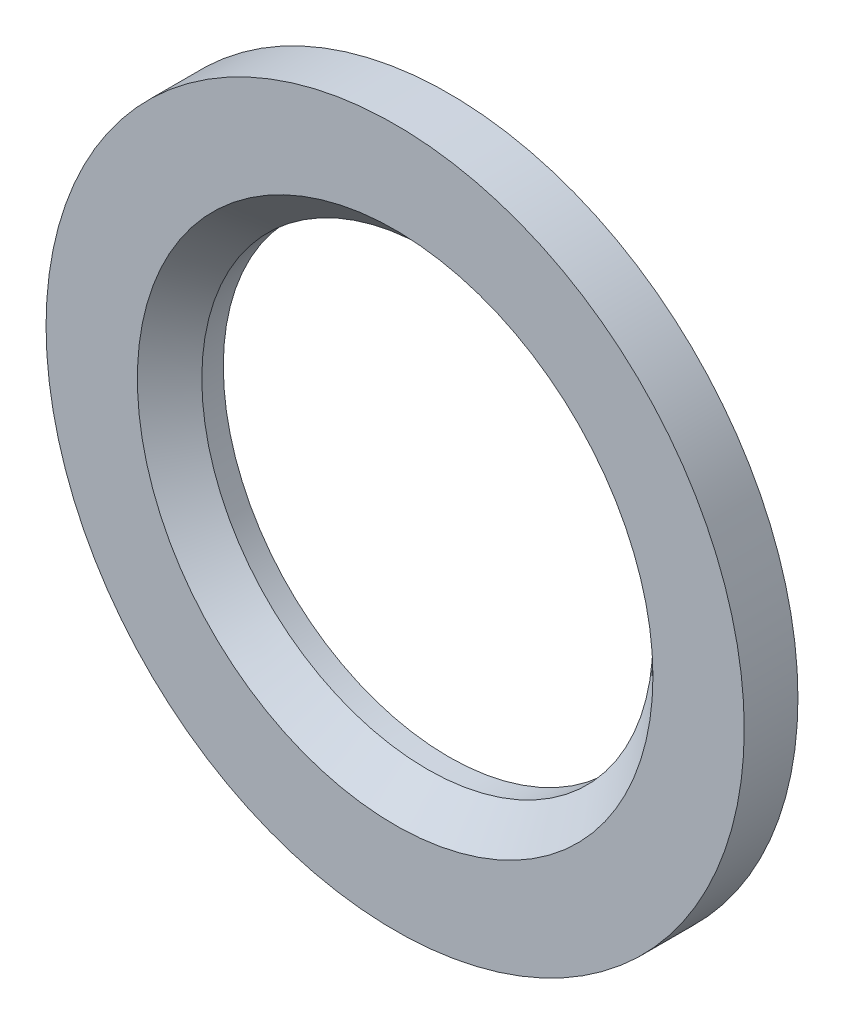
ISO-10303-21;
HEADER;
FILE_DESCRIPTION(('STEP AP214'),'2;1');
FILE_NAME('part.step','',(''),(''),'','','');
FILE_SCHEMA(('AUTOMOTIVE_DESIGN { 1 0 10303 214 1 1 1 1 }'));
ENDSEC;
DATA;
#1=APPLICATION_CONTEXT('core data for automotive mechanical design processes');
#2=APPLICATION_PROTOCOL_DEFINITION('international standard','automotive_design',2000,#1);
#3=PRODUCT_CONTEXT('',#1,'mechanical');
#4=PRODUCT('Part','Part','',(#3));
#5=PRODUCT_RELATED_PRODUCT_CATEGORY('part','',(#4));
#6=PRODUCT_DEFINITION_FORMATION('','',#4);
#7=PRODUCT_DEFINITION_CONTEXT('part definition',#1,'design');
#8=PRODUCT_DEFINITION('design','',#6,#7);
#9=PRODUCT_DEFINITION_SHAPE('','',#8);
#10=(LENGTH_UNIT() NAMED_UNIT(*) SI_UNIT(.MILLI.,.METRE.));
#11=(NAMED_UNIT(*) PLANE_ANGLE_UNIT() SI_UNIT($,.RADIAN.));
#12=(NAMED_UNIT(*) SI_UNIT($,.STERADIAN.) SOLID_ANGLE_UNIT());
#13=UNCERTAINTY_MEASURE_WITH_UNIT(LENGTH_MEASURE(1.E-05),#10,'distance_accuracy_value','');
#14=(GEOMETRIC_REPRESENTATION_CONTEXT(3) GLOBAL_UNCERTAINTY_ASSIGNED_CONTEXT((#13)) GLOBAL_UNIT_ASSIGNED_CONTEXT((#10,
#11,#12)) REPRESENTATION_CONTEXT('',''));
#15=CARTESIAN_POINT('',(0.,0.,0.));
#16=DIRECTION('',(0.,0.,1.));
#17=DIRECTION('',(1.,0.,0.));
#18=AXIS2_PLACEMENT_3D('',#15,#16,#17);
#19=CARTESIAN_POINT('',(0.,0.,1.));
#20=DIRECTION('',(0.,0.,1.));
#21=DIRECTION('',(1.,0.,0.));
#22=AXIS2_PLACEMENT_3D('',#19,#20,#21);
#23=PLANE('',#22);
#24=CARTESIAN_POINT('',(0.,0.,1.));
#25=DIRECTION('',(0.,0.,1.));
#26=DIRECTION('',(1.,0.,0.));
#27=AXIS2_PLACEMENT_3D('',#24,#25,#26);
#28=CIRCLE('',#27,4.8);
#29=CARTESIAN_POINT('',(4.8,0.,1.));
#30=VERTEX_POINT('',#29);
#31=EDGE_CURVE('E10',#30,#30,#28,.F.);
#32=ORIENTED_EDGE('',*,*,#31,.T.);
#33=EDGE_LOOP('',(#32));
#34=FACE_BOUND('',#33,.T.);
#35=CARTESIAN_POINT('',(0.,0.,1.));
#36=DIRECTION('',(0.,0.,1.));
#37=DIRECTION('',(1.,0.,0.));
#38=AXIS2_PLACEMENT_3D('',#35,#36,#37);
#39=CIRCLE('',#38,6.5);
#40=CARTESIAN_POINT('',(6.5,0.,1.));
#41=VERTEX_POINT('',#40);
#42=EDGE_CURVE('E42',#41,#41,#39,.T.);
#43=ORIENTED_EDGE('',*,*,#42,.T.);
#44=EDGE_LOOP('',(#43));
#45=FACE_BOUND('',#44,.T.);
#46=ADVANCED_FACE('F31',(#34,#45),#23,.T.);
#47=CARTESIAN_POINT('',(0.,0.,0.));
#48=DIRECTION('',(0.,0.,1.));
#49=DIRECTION('',(1.,0.,0.));
#50=AXIS2_PLACEMENT_3D('',#47,#48,#49);
#51=PLANE('',#50);
#52=CARTESIAN_POINT('',(0.,0.,0.));
#53=DIRECTION('',(0.,0.,1.));
#54=DIRECTION('',(1.,0.,0.));
#55=AXIS2_PLACEMENT_3D('',#52,#53,#54);
#56=CIRCLE('',#55,6.5);
#57=CARTESIAN_POINT('',(6.5,0.,0.));
#58=VERTEX_POINT('',#57);
#59=EDGE_CURVE('E46',#58,#58,#56,.T.);
#60=ORIENTED_EDGE('',*,*,#59,.F.);
#61=EDGE_LOOP('',(#60));
#62=FACE_BOUND('',#61,.T.);
#63=CARTESIAN_POINT('',(0.,0.,0.));
#64=DIRECTION('',(0.,0.,1.));
#65=DIRECTION('',(1.,0.,0.));
#66=AXIS2_PLACEMENT_3D('',#63,#64,#65);
#67=CIRCLE('',#66,4.2);
#68=CARTESIAN_POINT('',(4.2,0.,0.));
#69=VERTEX_POINT('',#68);
#70=EDGE_CURVE('E50',#69,#69,#67,.T.);
#71=ORIENTED_EDGE('',*,*,#70,.T.);
#72=EDGE_LOOP('',(#71));
#73=FACE_BOUND('',#72,.T.);
#74=ADVANCED_FACE('F55',(#62,#73),#51,.F.);
#75=CARTESIAN_POINT('',(0.,0.,1.));
#76=DIRECTION('',(0.,0.,-1.));
#77=DIRECTION('',(-1.,0.,0.));
#78=AXIS2_PLACEMENT_3D('',#75,#76,#77);
#79=CYLINDRICAL_SURFACE('',#78,6.5);
#80=ORIENTED_EDGE('',*,*,#42,.F.);
#81=EDGE_LOOP('',(#80));
#82=FACE_BOUND('',#81,.T.);
#83=ORIENTED_EDGE('',*,*,#59,.T.);
#84=EDGE_LOOP('',(#83));
#85=FACE_BOUND('',#84,.T.);
#86=ADVANCED_FACE('F59',(#82,#85),#79,.T.);
#87=CARTESIAN_POINT('',(0.,0.,1.));
#88=DIRECTION('',(0.,0.,-1.));
#89=DIRECTION('',(-1.,0.,0.));
#90=AXIS2_PLACEMENT_3D('',#87,#88,#89);
#91=CYLINDRICAL_SURFACE('',#90,4.2);
#92=CARTESIAN_POINT('',(0.,0.,0.400000000000004));
#93=DIRECTION('',(0.,0.,1.));
#94=DIRECTION('',(1.,0.,0.));
#95=AXIS2_PLACEMENT_3D('',#92,#93,#94);
#96=CIRCLE('',#95,4.2);
#97=CARTESIAN_POINT('',(4.2,0.,0.400000000000004));
#98=VERTEX_POINT('',#97);
#99=EDGE_CURVE('E38',#98,#98,#96,.T.);
#100=ORIENTED_EDGE('',*,*,#99,.T.);
#101=EDGE_LOOP('',(#100));
#102=FACE_BOUND('',#101,.T.);
#103=ORIENTED_EDGE('',*,*,#70,.F.);
#104=EDGE_LOOP('',(#103));
#105=FACE_BOUND('',#104,.T.);
#106=ADVANCED_FACE('F57',(#102,#105),#91,.F.);
#107=CARTESIAN_POINT('',(0.,0.,0.400000000000004));
#108=DIRECTION('',(0.,0.,1.));
#109=DIRECTION('',(1.,0.,0.));
#110=AXIS2_PLACEMENT_3D('',#107,#108,#109);
#111=CONICAL_SURFACE('',#110,4.2,0.785398163397453);
#112=ORIENTED_EDGE('',*,*,#31,.F.);
#113=EDGE_LOOP('',(#112));
#114=FACE_BOUND('',#113,.T.);
#115=ORIENTED_EDGE('',*,*,#99,.F.);
#116=EDGE_LOOP('',(#115));
#117=FACE_BOUND('',#116,.T.);
#118=ADVANCED_FACE('F33',(#114,#117),#111,.F.);
#119=CLOSED_SHELL('',(#46,#74,#86,#106,#118));
#120=MANIFOLD_SOLID_BREP('B2',#119);
#121=ADVANCED_BREP_SHAPE_REPRESENTATION('',(#18,#120),#14);
#122=SHAPE_DEFINITION_REPRESENTATION(#9,#121);
ENDSEC;
END-ISO-10303-21;
